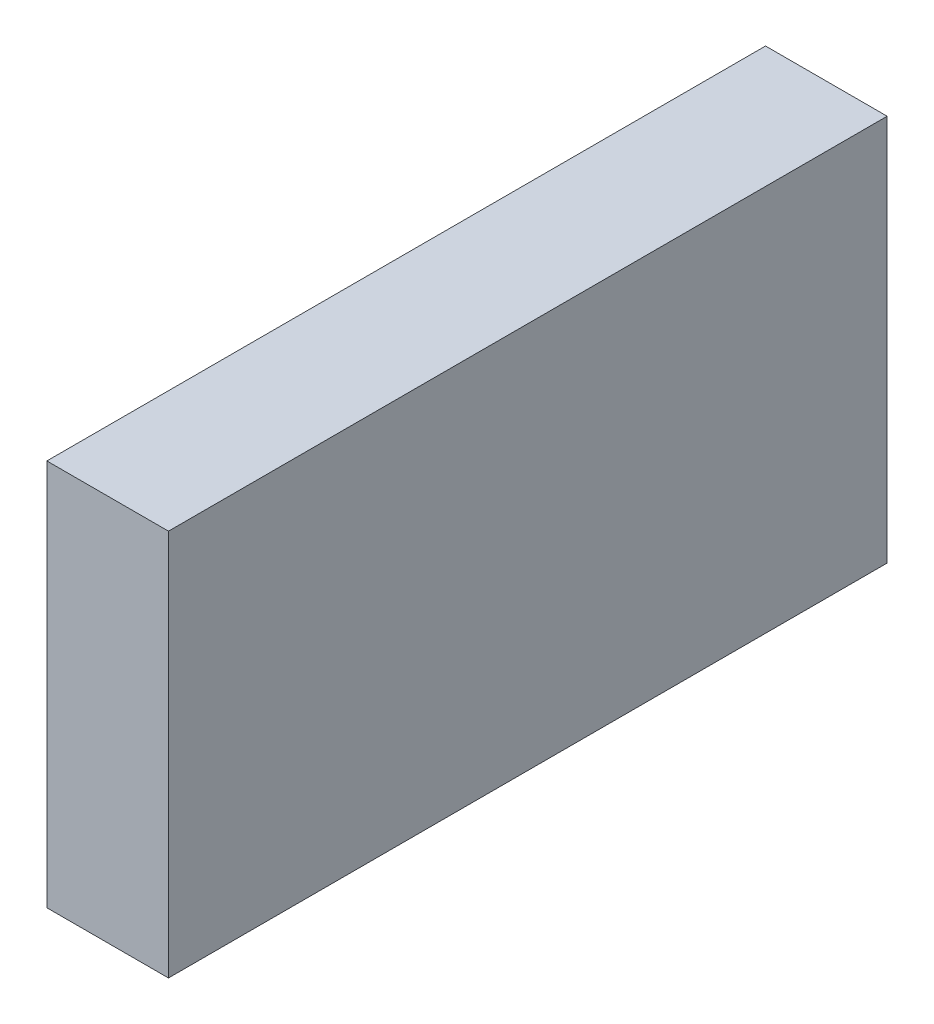
ISO-10303-21;
HEADER;
FILE_DESCRIPTION(('STEP AP214'),'2;1');
FILE_NAME('part.step','',(''),(''),'','','');
FILE_SCHEMA(('AUTOMOTIVE_DESIGN { 1 0 10303 214 1 1 1 1 }'));
ENDSEC;
DATA;
#1=APPLICATION_CONTEXT('core data for automotive mechanical design processes');
#2=APPLICATION_PROTOCOL_DEFINITION('international standard','automotive_design',2000,#1);
#3=PRODUCT_CONTEXT('',#1,'mechanical');
#4=PRODUCT('Part','Part','',(#3));
#5=PRODUCT_RELATED_PRODUCT_CATEGORY('part','',(#4));
#6=PRODUCT_DEFINITION_FORMATION('','',#4);
#7=PRODUCT_DEFINITION_CONTEXT('part definition',#1,'design');
#8=PRODUCT_DEFINITION('design','',#6,#7);
#9=PRODUCT_DEFINITION_SHAPE('','',#8);
#10=(LENGTH_UNIT() NAMED_UNIT(*) SI_UNIT(.MILLI.,.METRE.));
#11=(NAMED_UNIT(*) PLANE_ANGLE_UNIT() SI_UNIT($,.RADIAN.));
#12=(NAMED_UNIT(*) SI_UNIT($,.STERADIAN.) SOLID_ANGLE_UNIT());
#13=UNCERTAINTY_MEASURE_WITH_UNIT(LENGTH_MEASURE(1.E-05),#10,'distance_accuracy_value','');
#14=(GEOMETRIC_REPRESENTATION_CONTEXT(3) GLOBAL_UNCERTAINTY_ASSIGNED_CONTEXT((#13)) GLOBAL_UNIT_ASSIGNED_CONTEXT((#10,
#11,#12)) REPRESENTATION_CONTEXT('',''));
#15=CARTESIAN_POINT('',(0.,0.,0.));
#16=DIRECTION('',(0.,0.,1.));
#17=DIRECTION('',(1.,0.,0.));
#18=AXIS2_PLACEMENT_3D('',#15,#16,#17);
#19=CARTESIAN_POINT('',(0.,70.,0.));
#20=DIRECTION('',(1.,0.,0.));
#21=DIRECTION('',(0.,0.,-1.));
#22=AXIS2_PLACEMENT_3D('',#19,#20,#21);
#23=PLANE('',#22);
#24=DIRECTION('',(0.,0.,1.));
#25=VECTOR('',#24,1.);
#26=CARTESIAN_POINT('',(0.,0.,0.));
#27=LINE('',#26,#25);
#28=CARTESIAN_POINT('',(0.,0.,-130.));
#29=VERTEX_POINT('',#28);
#30=CARTESIAN_POINT('',(0.,0.,0.));
#31=VERTEX_POINT('',#30);
#32=EDGE_CURVE('E94',#29,#31,#27,.T.);
#33=ORIENTED_EDGE('',*,*,#32,.T.);
#34=DIRECTION('',(0.,-1.,0.));
#35=VECTOR('',#34,1.);
#36=CARTESIAN_POINT('',(0.,70.,0.));
#37=LINE('',#36,#35);
#38=CARTESIAN_POINT('',(0.,70.,0.));
#39=VERTEX_POINT('',#38);
#40=EDGE_CURVE('E11',#39,#31,#37,.T.);
#41=ORIENTED_EDGE('',*,*,#40,.F.);
#42=DIRECTION('',(0.,0.,1.));
#43=VECTOR('',#42,1.);
#44=CARTESIAN_POINT('',(0.,70.,0.));
#45=LINE('',#44,#43);
#46=CARTESIAN_POINT('',(0.,70.,-130.));
#47=VERTEX_POINT('',#46);
#48=EDGE_CURVE('E82',#47,#39,#45,.T.);
#49=ORIENTED_EDGE('',*,*,#48,.F.);
#50=DIRECTION('',(0.,-1.,0.));
#51=VECTOR('',#50,1.);
#52=CARTESIAN_POINT('',(0.,70.,-130.));
#53=LINE('',#52,#51);
#54=EDGE_CURVE('E90',#47,#29,#53,.T.);
#55=ORIENTED_EDGE('',*,*,#54,.T.);
#56=EDGE_LOOP('',(#33,#41,#49,#55));
#57=FACE_BOUND('',#56,.T.);
#58=ADVANCED_FACE('F31',(#57),#23,.F.);
#59=CARTESIAN_POINT('',(0.,70.,0.));
#60=DIRECTION('',(0.,0.,-1.));
#61=DIRECTION('',(-1.,0.,0.));
#62=AXIS2_PLACEMENT_3D('',#59,#60,#61);
#63=PLANE('',#62);
#64=DIRECTION('',(1.,0.,0.));
#65=VECTOR('',#64,1.);
#66=CARTESIAN_POINT('',(0.,0.,0.));
#67=LINE('',#66,#65);
#68=CARTESIAN_POINT('',(22.,0.,0.));
#69=VERTEX_POINT('',#68);
#70=EDGE_CURVE('E86',#31,#69,#67,.T.);
#71=ORIENTED_EDGE('',*,*,#70,.T.);
#72=DIRECTION('',(0.,-1.,0.));
#73=VECTOR('',#72,1.);
#74=CARTESIAN_POINT('',(22.,70.,0.));
#75=LINE('',#74,#73);
#76=CARTESIAN_POINT('',(22.,70.,0.));
#77=VERTEX_POINT('',#76);
#78=EDGE_CURVE('E39',#77,#69,#75,.T.);
#79=ORIENTED_EDGE('',*,*,#78,.F.);
#80=DIRECTION('',(1.,0.,0.));
#81=VECTOR('',#80,1.);
#82=CARTESIAN_POINT('',(0.,70.,0.));
#83=LINE('',#82,#81);
#84=EDGE_CURVE('E77',#39,#77,#83,.T.);
#85=ORIENTED_EDGE('',*,*,#84,.F.);
#86=ORIENTED_EDGE('',*,*,#40,.T.);
#87=EDGE_LOOP('',(#71,#79,#85,#86));
#88=FACE_BOUND('',#87,.T.);
#89=ADVANCED_FACE('F85',(#88),#63,.F.);
#90=CARTESIAN_POINT('',(22.,70.,0.));
#91=DIRECTION('',(-1.,0.,0.));
#92=DIRECTION('',(0.,0.,1.));
#93=AXIS2_PLACEMENT_3D('',#90,#91,#92);
#94=PLANE('',#93);
#95=DIRECTION('',(0.,0.,-1.));
#96=VECTOR('',#95,1.);
#97=CARTESIAN_POINT('',(22.,0.,0.));
#98=LINE('',#97,#96);
#99=CARTESIAN_POINT('',(22.,0.,-130.));
#100=VERTEX_POINT('',#99);
#101=EDGE_CURVE('E64',#69,#100,#98,.T.);
#102=ORIENTED_EDGE('',*,*,#101,.T.);
#103=DIRECTION('',(0.,-1.,0.));
#104=VECTOR('',#103,1.);
#105=CARTESIAN_POINT('',(22.,70.,-130.));
#106=LINE('',#105,#104);
#107=CARTESIAN_POINT('',(22.,70.,-130.));
#108=VERTEX_POINT('',#107);
#109=EDGE_CURVE('E87',#108,#100,#106,.T.);
#110=ORIENTED_EDGE('',*,*,#109,.F.);
#111=DIRECTION('',(0.,0.,-1.));
#112=VECTOR('',#111,1.);
#113=CARTESIAN_POINT('',(22.,70.,0.));
#114=LINE('',#113,#112);
#115=EDGE_CURVE('E80',#77,#108,#114,.T.);
#116=ORIENTED_EDGE('',*,*,#115,.F.);
#117=ORIENTED_EDGE('',*,*,#78,.T.);
#118=EDGE_LOOP('',(#102,#110,#116,#117));
#119=FACE_BOUND('',#118,.T.);
#120=ADVANCED_FACE('F88',(#119),#94,.F.);
#121=CARTESIAN_POINT('',(0.,70.,-130.));
#122=DIRECTION('',(0.,0.,1.));
#123=DIRECTION('',(1.,0.,0.));
#124=AXIS2_PLACEMENT_3D('',#121,#122,#123);
#125=PLANE('',#124);
#126=DIRECTION('',(-1.,0.,0.));
#127=VECTOR('',#126,1.);
#128=CARTESIAN_POINT('',(0.,0.,-130.));
#129=LINE('',#128,#127);
#130=EDGE_CURVE('E70',#100,#29,#129,.T.);
#131=ORIENTED_EDGE('',*,*,#130,.T.);
#132=ORIENTED_EDGE('',*,*,#54,.F.);
#133=DIRECTION('',(-1.,0.,0.));
#134=VECTOR('',#133,1.);
#135=CARTESIAN_POINT('',(0.,70.,-130.));
#136=LINE('',#135,#134);
#137=EDGE_CURVE('E47',#108,#47,#136,.T.);
#138=ORIENTED_EDGE('',*,*,#137,.F.);
#139=ORIENTED_EDGE('',*,*,#109,.T.);
#140=EDGE_LOOP('',(#131,#132,#138,#139));
#141=FACE_BOUND('',#140,.T.);
#142=ADVANCED_FACE('F101',(#141),#125,.F.);
#143=CARTESIAN_POINT('',(0.,70.,-130.));
#144=DIRECTION('',(0.,-1.,0.));
#145=DIRECTION('',(0.,0.,-1.));
#146=AXIS2_PLACEMENT_3D('',#143,#144,#145);
#147=PLANE('',#146);
#148=ORIENTED_EDGE('',*,*,#48,.T.);
#149=ORIENTED_EDGE('',*,*,#84,.T.);
#150=ORIENTED_EDGE('',*,*,#115,.T.);
#151=ORIENTED_EDGE('',*,*,#137,.T.);
#152=EDGE_LOOP('',(#148,#149,#150,#151));
#153=FACE_BOUND('',#152,.T.);
#154=ADVANCED_FACE('F78',(#153),#147,.F.);
#155=CARTESIAN_POINT('',(0.,0.,-130.));
#156=DIRECTION('',(0.,-1.,0.));
#157=DIRECTION('',(0.,0.,-1.));
#158=AXIS2_PLACEMENT_3D('',#155,#156,#157);
#159=PLANE('',#158);
#160=ORIENTED_EDGE('',*,*,#32,.F.);
#161=ORIENTED_EDGE('',*,*,#130,.F.);
#162=ORIENTED_EDGE('',*,*,#101,.F.);
#163=ORIENTED_EDGE('',*,*,#70,.F.);
#164=EDGE_LOOP('',(#160,#161,#162,#163));
#165=FACE_BOUND('',#164,.T.);
#166=ADVANCED_FACE('F104',(#165),#159,.T.);
#167=CLOSED_SHELL('',(#58,#89,#120,#142,#154,#166));
#168=MANIFOLD_SOLID_BREP('B2',#167);
#169=ADVANCED_BREP_SHAPE_REPRESENTATION('',(#18,#168),#14);
#170=SHAPE_DEFINITION_REPRESENTATION(#9,#169);
ENDSEC;
END-ISO-10303-21;
